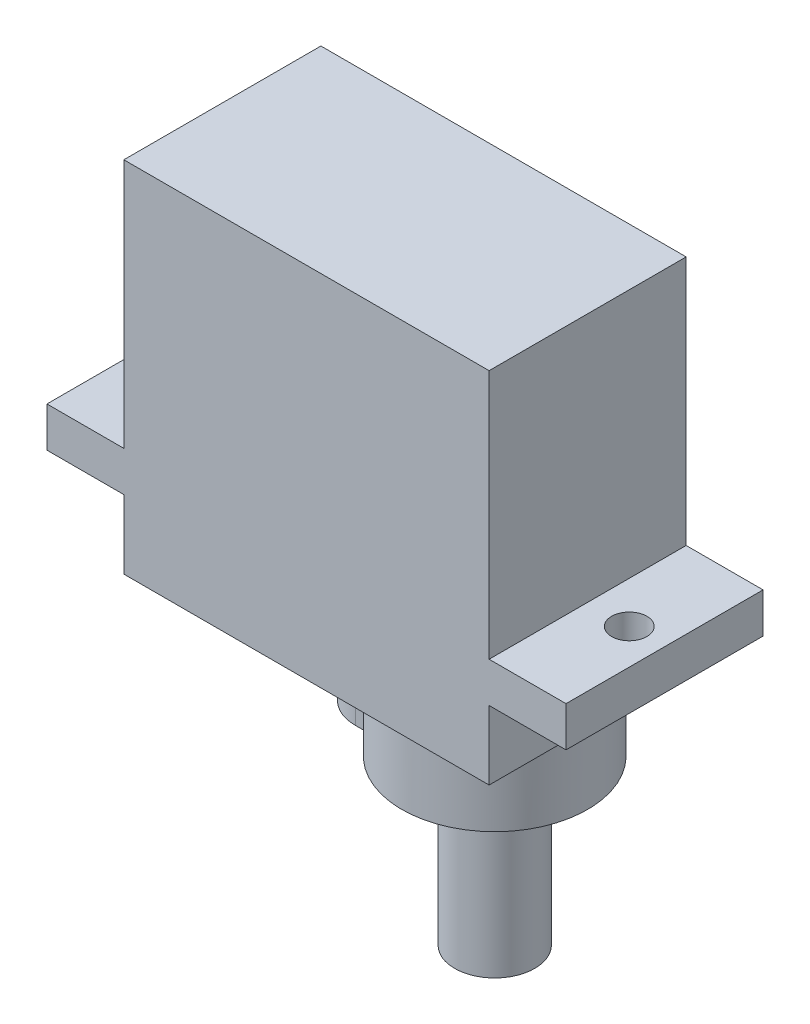
ISO-10303-21;
HEADER;
FILE_DESCRIPTION(('STEP AP214'),'2;1');
FILE_NAME('part.step','',(''),(''),'','','');
FILE_SCHEMA(('AUTOMOTIVE_DESIGN { 1 0 10303 214 1 1 1 1 }'));
ENDSEC;
DATA;
#1=APPLICATION_CONTEXT('core data for automotive mechanical design processes');
#2=APPLICATION_PROTOCOL_DEFINITION('international standard','automotive_design',2000,#1);
#3=PRODUCT_CONTEXT('',#1,'mechanical');
#4=PRODUCT('Part','Part','',(#3));
#5=PRODUCT_RELATED_PRODUCT_CATEGORY('part','',(#4));
#6=PRODUCT_DEFINITION_FORMATION('','',#4);
#7=PRODUCT_DEFINITION_CONTEXT('part definition',#1,'design');
#8=PRODUCT_DEFINITION('design','',#6,#7);
#9=PRODUCT_DEFINITION_SHAPE('','',#8);
#10=(LENGTH_UNIT() NAMED_UNIT(*) SI_UNIT(.MILLI.,.METRE.));
#11=(NAMED_UNIT(*) PLANE_ANGLE_UNIT() SI_UNIT($,.RADIAN.));
#12=(NAMED_UNIT(*) SI_UNIT($,.STERADIAN.) SOLID_ANGLE_UNIT());
#13=UNCERTAINTY_MEASURE_WITH_UNIT(LENGTH_MEASURE(1.E-05),#10,'distance_accuracy_value','');
#14=(GEOMETRIC_REPRESENTATION_CONTEXT(3) GLOBAL_UNCERTAINTY_ASSIGNED_CONTEXT((#13)) GLOBAL_UNIT_ASSIGNED_CONTEXT((#10,
#11,#12)) REPRESENTATION_CONTEXT('',''));
#15=CARTESIAN_POINT('',(0.,0.,0.));
#16=DIRECTION('',(0.,0.,1.));
#17=DIRECTION('',(1.,0.,0.));
#18=AXIS2_PLACEMENT_3D('',#15,#16,#17);
#19=CARTESIAN_POINT('',(5.60000000000001,-18.9406492438332,6.15));
#20=DIRECTION('',(0.,1.,0.));
#21=DIRECTION('',(-1.,0.,0.));
#22=AXIS2_PLACEMENT_3D('',#19,#20,#21);
#23=CYLINDRICAL_SURFACE('',#22,2.5);
#24=CARTESIAN_POINT('',(5.60000000000001,-18.9406492438332,6.15));
#25=DIRECTION('',(0.,-1.,0.));
#26=DIRECTION('',(1.,0.,0.));
#27=AXIS2_PLACEMENT_3D('',#24,#25,#26);
#28=CIRCLE('',#27,2.5);
#29=CARTESIAN_POINT('',(8.10000000000001,-18.9406492438332,6.15));
#30=VERTEX_POINT('',#29);
#31=EDGE_CURVE('E12',#30,#30,#28,.T.);
#32=ORIENTED_EDGE('',*,*,#31,.F.);
#33=EDGE_LOOP('',(#32));
#34=FACE_BOUND('',#33,.T.);
#35=CARTESIAN_POINT('',(5.60000000000001,-8.7,6.15));
#36=DIRECTION('',(0.,-1.,0.));
#37=DIRECTION('',(1.,0.,0.));
#38=AXIS2_PLACEMENT_3D('',#35,#36,#37);
#39=CIRCLE('',#38,2.5);
#40=CARTESIAN_POINT('',(8.10000000000001,-8.7,6.15));
#41=VERTEX_POINT('',#40);
#42=EDGE_CURVE('E46',#41,#41,#39,.T.);
#43=ORIENTED_EDGE('',*,*,#42,.T.);
#44=EDGE_LOOP('',(#43));
#45=FACE_BOUND('',#44,.T.);
#46=ADVANCED_FACE('F43',(#34,#45),#23,.T.);
#47=CARTESIAN_POINT('',(5.60000000000001,-18.9406492438332,6.15));
#48=DIRECTION('',(0.,-1.,0.));
#49=DIRECTION('',(1.,0.,0.));
#50=AXIS2_PLACEMENT_3D('',#47,#48,#49);
#51=PLANE('',#50);
#52=ORIENTED_EDGE('',*,*,#31,.T.);
#53=EDGE_LOOP('',(#52));
#54=FACE_BOUND('',#53,.T.);
#55=ADVANCED_FACE('F58',(#54),#51,.T.);
#56=CARTESIAN_POINT('',(5.60000000000001,-8.7,6.15));
#57=DIRECTION('',(0.,-1.,0.));
#58=DIRECTION('',(1.,0.,0.));
#59=AXIS2_PLACEMENT_3D('',#56,#57,#58);
#60=PLANE('',#59);
#61=ORIENTED_EDGE('',*,*,#42,.F.);
#62=EDGE_LOOP('',(#61));
#63=FACE_BOUND('',#62,.T.);
#64=ADVANCED_FACE('F56',(#63),#60,.F.);
#65=CLOSED_SHELL('',(#46,#55,#64));
#66=MANIFOLD_SOLID_BREP('B2',#65);
#67=CARTESIAN_POINT('',(-11.4,-4.3,12.3));
#68=DIRECTION('',(0.,1.,0.));
#69=DIRECTION('',(-1.,0.,0.));
#70=AXIS2_PLACEMENT_3D('',#67,#68,#69);
#71=PLANE('',#70);
#72=DIRECTION('',(-1.,0.,0.));
#73=VECTOR('',#72,1.);
#74=CARTESIAN_POINT('',(-0.399999999999992,-4.3,8.85));
#75=LINE('',#74,#73);
#76=CARTESIAN_POINT('',(0.466774892915768,-4.3,8.85));
#77=VERTEX_POINT('',#76);
#78=CARTESIAN_POINT('',(-0.399999999999992,-4.3,8.85));
#79=VERTEX_POINT('',#78);
#80=EDGE_CURVE('E100',#77,#79,#75,.T.);
#81=ORIENTED_EDGE('',*,*,#80,.F.);
#82=CARTESIAN_POINT('',(5.60000000000001,-4.3,6.15));
#83=DIRECTION('',(0.,-1.,0.));
#84=DIRECTION('',(1.,0.,0.));
#85=AXIS2_PLACEMENT_3D('',#82,#83,#84);
#86=CIRCLE('',#85,5.8);
#87=CARTESIAN_POINT('',(11.4,-4.3,6.15));
#88=VERTEX_POINT('',#87);
#89=EDGE_CURVE('E41',#88,#77,#86,.T.);
#90=ORIENTED_EDGE('',*,*,#89,.F.);
#91=DIRECTION('',(0.,0.,-1.));
#92=VECTOR('',#91,1.);
#93=CARTESIAN_POINT('',(11.4,-4.3,12.3));
#94=LINE('',#93,#92);
#95=CARTESIAN_POINT('',(11.4,-4.3,12.3));
#96=VERTEX_POINT('',#95);
#97=EDGE_CURVE('E301',#96,#88,#94,.T.);
#98=ORIENTED_EDGE('',*,*,#97,.F.);
#99=DIRECTION('',(1.,0.,0.));
#100=VECTOR('',#99,1.);
#101=CARTESIAN_POINT('',(-11.4,-4.3,12.3));
#102=LINE('',#101,#100);
#103=CARTESIAN_POINT('',(-11.4,-4.3,12.3));
#104=VERTEX_POINT('',#103);
#105=EDGE_CURVE('E237',#104,#96,#102,.T.);
#106=ORIENTED_EDGE('',*,*,#105,.F.);
#107=DIRECTION('',(0.,0.,-1.));
#108=VECTOR('',#107,1.);
#109=CARTESIAN_POINT('',(-11.4,-4.3,12.3));
#110=LINE('',#109,#108);
#111=CARTESIAN_POINT('',(-11.4,-4.3,0.));
#112=VERTEX_POINT('',#111);
#113=EDGE_CURVE('E304',#104,#112,#110,.T.);
#114=ORIENTED_EDGE('',*,*,#113,.T.);
#115=DIRECTION('',(1.,0.,0.));
#116=VECTOR('',#115,1.);
#117=CARTESIAN_POINT('',(-11.4,-4.3,0.));
#118=LINE('',#117,#116);
#119=CARTESIAN_POINT('',(11.4,-4.3,0.));
#120=VERTEX_POINT('',#119);
#121=EDGE_CURVE('E259',#112,#120,#118,.T.);
#122=ORIENTED_EDGE('',*,*,#121,.T.);
#123=EDGE_CURVE('E300',#88,#120,#94,.T.);
#124=ORIENTED_EDGE('',*,*,#123,.F.);
#125=CARTESIAN_POINT('',(0.466774892915769,-4.3,3.45));
#126=VERTEX_POINT('',#125);
#127=EDGE_CURVE('E93',#126,#88,#86,.T.);
#128=ORIENTED_EDGE('',*,*,#127,.F.);
#129=DIRECTION('',(1.,0.,0.));
#130=VECTOR('',#129,1.);
#131=CARTESIAN_POINT('',(-0.399999999999992,-4.3,3.45));
#132=LINE('',#131,#130);
#133=CARTESIAN_POINT('',(-0.399999999999992,-4.3,3.45));
#134=VERTEX_POINT('',#133);
#135=EDGE_CURVE('E370',#134,#126,#132,.T.);
#136=ORIENTED_EDGE('',*,*,#135,.F.);
#137=CARTESIAN_POINT('',(-0.399999999999992,-4.3,6.15));
#138=DIRECTION('',(0.,-1.,0.));
#139=DIRECTION('',(1.,0.,0.));
#140=AXIS2_PLACEMENT_3D('',#137,#138,#139);
#141=CIRCLE('',#140,2.7);
#142=EDGE_CURVE('E104',#79,#134,#141,.T.);
#143=ORIENTED_EDGE('',*,*,#142,.F.);
#144=EDGE_LOOP('',(#81,#90,#98,#106,#114,#122,#124,#128,#136,#143));
#145=FACE_BOUND('',#144,.T.);
#146=ADVANCED_FACE('F83',(#145),#71,.F.);
#147=CARTESIAN_POINT('',(-16.2,2.5,12.3));
#148=DIRECTION('',(1.,0.,0.));
#149=DIRECTION('',(0.,0.,-1.));
#150=AXIS2_PLACEMENT_3D('',#147,#148,#149);
#151=PLANE('',#150);
#152=DIRECTION('',(0.,-1.,0.));
#153=VECTOR('',#152,1.);
#154=CARTESIAN_POINT('',(-16.2,2.5,0.));
#155=LINE('',#154,#153);
#156=CARTESIAN_POINT('',(-16.2,2.5,0.));
#157=VERTEX_POINT('',#156);
#158=CARTESIAN_POINT('',(-16.2,0.,0.));
#159=VERTEX_POINT('',#158);
#160=EDGE_CURVE('E220',#157,#159,#155,.T.);
#161=ORIENTED_EDGE('',*,*,#160,.T.);
#162=DIRECTION('',(0.,0.,-1.));
#163=VECTOR('',#162,1.);
#164=CARTESIAN_POINT('',(-16.2,0.,12.3));
#165=LINE('',#164,#163);
#166=CARTESIAN_POINT('',(-16.2,0.,12.3));
#167=VERTEX_POINT('',#166);
#168=EDGE_CURVE('E87',#167,#159,#165,.T.);
#169=ORIENTED_EDGE('',*,*,#168,.F.);
#170=DIRECTION('',(0.,-1.,0.));
#171=VECTOR('',#170,1.);
#172=CARTESIAN_POINT('',(-16.2,2.5,12.3));
#173=LINE('',#172,#171);
#174=CARTESIAN_POINT('',(-16.2,2.5,12.3));
#175=VERTEX_POINT('',#174);
#176=EDGE_CURVE('E229',#175,#167,#173,.T.);
#177=ORIENTED_EDGE('',*,*,#176,.F.);
#178=DIRECTION('',(0.,0.,-1.));
#179=VECTOR('',#178,1.);
#180=CARTESIAN_POINT('',(-16.2,2.5,12.3));
#181=LINE('',#180,#179);
#182=EDGE_CURVE('E254',#175,#157,#181,.T.);
#183=ORIENTED_EDGE('',*,*,#182,.T.);
#184=EDGE_LOOP('',(#161,#169,#177,#183));
#185=FACE_BOUND('',#184,.T.);
#186=ADVANCED_FACE('F85',(#185),#151,.F.);
#187=CARTESIAN_POINT('',(-16.2,0.,12.3));
#188=DIRECTION('',(0.,1.,0.));
#189=DIRECTION('',(-1.,0.,0.));
#190=AXIS2_PLACEMENT_3D('',#187,#188,#189);
#191=PLANE('',#190);
#192=CARTESIAN_POINT('',(-14.,0.,6.15));
#193=DIRECTION('',(0.,1.,0.));
#194=DIRECTION('',(-1.,0.,0.));
#195=AXIS2_PLACEMENT_3D('',#192,#193,#194);
#196=CIRCLE('',#195,1.1);
#197=CARTESIAN_POINT('',(-15.1,0.,6.15));
#198=VERTEX_POINT('',#197);
#199=EDGE_CURVE('E380',#198,#198,#196,.T.);
#200=ORIENTED_EDGE('',*,*,#199,.T.);
#201=EDGE_LOOP('',(#200));
#202=FACE_BOUND('',#201,.T.);
#203=DIRECTION('',(1.,0.,0.));
#204=VECTOR('',#203,1.);
#205=CARTESIAN_POINT('',(-16.2,0.,0.));
#206=LINE('',#205,#204);
#207=CARTESIAN_POINT('',(-11.4,0.,0.));
#208=VERTEX_POINT('',#207);
#209=EDGE_CURVE('E223',#159,#208,#206,.T.);
#210=ORIENTED_EDGE('',*,*,#209,.T.);
#211=DIRECTION('',(0.,0.,-1.));
#212=VECTOR('',#211,1.);
#213=CARTESIAN_POINT('',(-11.4,0.,12.3));
#214=LINE('',#213,#212);
#215=CARTESIAN_POINT('',(-11.4,0.,12.3));
#216=VERTEX_POINT('',#215);
#217=EDGE_CURVE('E306',#216,#208,#214,.T.);
#218=ORIENTED_EDGE('',*,*,#217,.F.);
#219=DIRECTION('',(1.,0.,0.));
#220=VECTOR('',#219,1.);
#221=CARTESIAN_POINT('',(-16.2,0.,12.3));
#222=LINE('',#221,#220);
#223=EDGE_CURVE('E232',#167,#216,#222,.T.);
#224=ORIENTED_EDGE('',*,*,#223,.F.);
#225=ORIENTED_EDGE('',*,*,#168,.T.);
#226=EDGE_LOOP('',(#210,#218,#224,#225));
#227=FACE_BOUND('',#226,.T.);
#228=ADVANCED_FACE('F315',(#202,#227),#191,.F.);
#229=CARTESIAN_POINT('',(-11.4,0.,12.3));
#230=DIRECTION('',(1.,0.,0.));
#231=DIRECTION('',(0.,0.,-1.));
#232=AXIS2_PLACEMENT_3D('',#229,#230,#231);
#233=PLANE('',#232);
#234=DIRECTION('',(0.,-1.,0.));
#235=VECTOR('',#234,1.);
#236=CARTESIAN_POINT('',(-11.4,0.,0.));
#237=LINE('',#236,#235);
#238=EDGE_CURVE('E257',#208,#112,#237,.T.);
#239=ORIENTED_EDGE('',*,*,#238,.T.);
#240=ORIENTED_EDGE('',*,*,#113,.F.);
#241=DIRECTION('',(0.,-1.,0.));
#242=VECTOR('',#241,1.);
#243=CARTESIAN_POINT('',(-11.4,0.,12.3));
#244=LINE('',#243,#242);
#245=EDGE_CURVE('E235',#216,#104,#244,.T.);
#246=ORIENTED_EDGE('',*,*,#245,.F.);
#247=ORIENTED_EDGE('',*,*,#217,.T.);
#248=EDGE_LOOP('',(#239,#240,#246,#247));
#249=FACE_BOUND('',#248,.T.);
#250=ADVANCED_FACE('F327',(#249),#233,.F.);
#251=CARTESIAN_POINT('',(11.4,-4.3,12.3));
#252=DIRECTION('',(-1.,0.,0.));
#253=DIRECTION('',(0.,-1.,0.));
#254=AXIS2_PLACEMENT_3D('',#251,#252,#253);
#255=PLANE('',#254);
#256=DIRECTION('',(0.,1.,0.));
#257=VECTOR('',#256,1.);
#258=CARTESIAN_POINT('',(11.4,-4.3,0.));
#259=LINE('',#258,#257);
#260=CARTESIAN_POINT('',(11.4,0.,0.));
#261=VERTEX_POINT('',#260);
#262=EDGE_CURVE('E262',#120,#261,#259,.T.);
#263=ORIENTED_EDGE('',*,*,#262,.T.);
#264=DIRECTION('',(0.,0.,-1.));
#265=VECTOR('',#264,1.);
#266=CARTESIAN_POINT('',(11.4,0.,12.3));
#267=LINE('',#266,#265);
#268=CARTESIAN_POINT('',(11.4,0.,12.3));
#269=VERTEX_POINT('',#268);
#270=EDGE_CURVE('E297',#269,#261,#267,.T.);
#271=ORIENTED_EDGE('',*,*,#270,.F.);
#272=DIRECTION('',(0.,1.,0.));
#273=VECTOR('',#272,1.);
#274=CARTESIAN_POINT('',(11.4,-4.3,12.3));
#275=LINE('',#274,#273);
#276=EDGE_CURVE('E239',#96,#269,#275,.T.);
#277=ORIENTED_EDGE('',*,*,#276,.F.);
#278=ORIENTED_EDGE('',*,*,#97,.T.);
#279=ORIENTED_EDGE('',*,*,#123,.T.);
#280=EDGE_LOOP('',(#263,#271,#277,#278,#279));
#281=FACE_BOUND('',#280,.T.);
#282=ADVANCED_FACE('F368',(#281),#255,.F.);
#283=CARTESIAN_POINT('',(11.4,0.,12.3));
#284=DIRECTION('',(0.,1.,0.));
#285=DIRECTION('',(-1.,0.,0.));
#286=AXIS2_PLACEMENT_3D('',#283,#284,#285);
#287=PLANE('',#286);
#288=CARTESIAN_POINT('',(14.,0.,6.15));
#289=DIRECTION('',(0.,1.,0.));
#290=DIRECTION('',(-1.,0.,0.));
#291=AXIS2_PLACEMENT_3D('',#288,#289,#290);
#292=CIRCLE('',#291,1.1);
#293=CARTESIAN_POINT('',(12.9,0.,6.15));
#294=VERTEX_POINT('',#293);
#295=EDGE_CURVE('E413',#294,#294,#292,.T.);
#296=ORIENTED_EDGE('',*,*,#295,.T.);
#297=EDGE_LOOP('',(#296));
#298=FACE_BOUND('',#297,.T.);
#299=DIRECTION('',(1.,0.,0.));
#300=VECTOR('',#299,1.);
#301=CARTESIAN_POINT('',(11.4,0.,0.));
#302=LINE('',#301,#300);
#303=CARTESIAN_POINT('',(16.2,0.,0.));
#304=VERTEX_POINT('',#303);
#305=EDGE_CURVE('E264',#261,#304,#302,.T.);
#306=ORIENTED_EDGE('',*,*,#305,.T.);
#307=DIRECTION('',(0.,0.,-1.));
#308=VECTOR('',#307,1.);
#309=CARTESIAN_POINT('',(16.2,0.,12.3));
#310=LINE('',#309,#308);
#311=CARTESIAN_POINT('',(16.2,0.,12.3));
#312=VERTEX_POINT('',#311);
#313=EDGE_CURVE('E294',#312,#304,#310,.T.);
#314=ORIENTED_EDGE('',*,*,#313,.F.);
#315=DIRECTION('',(1.,0.,0.));
#316=VECTOR('',#315,1.);
#317=CARTESIAN_POINT('',(11.4,0.,12.3));
#318=LINE('',#317,#316);
#319=EDGE_CURVE('E241',#269,#312,#318,.T.);
#320=ORIENTED_EDGE('',*,*,#319,.F.);
#321=ORIENTED_EDGE('',*,*,#270,.T.);
#322=EDGE_LOOP('',(#306,#314,#320,#321));
#323=FACE_BOUND('',#322,.T.);
#324=ADVANCED_FACE('F366',(#298,#323),#287,.F.);
#325=CARTESIAN_POINT('',(16.2,0.,12.3));
#326=DIRECTION('',(-1.,0.,0.));
#327=DIRECTION('',(0.,-1.,0.));
#328=AXIS2_PLACEMENT_3D('',#325,#326,#327);
#329=PLANE('',#328);
#330=DIRECTION('',(0.,1.,0.));
#331=VECTOR('',#330,1.);
#332=CARTESIAN_POINT('',(16.2,0.,0.));
#333=LINE('',#332,#331);
#334=CARTESIAN_POINT('',(16.2,2.5,0.));
#335=VERTEX_POINT('',#334);
#336=EDGE_CURVE('E266',#304,#335,#333,.T.);
#337=ORIENTED_EDGE('',*,*,#336,.T.);
#338=DIRECTION('',(0.,0.,-1.));
#339=VECTOR('',#338,1.);
#340=CARTESIAN_POINT('',(16.2,2.5,12.3));
#341=LINE('',#340,#339);
#342=CARTESIAN_POINT('',(16.2,2.5,12.3));
#343=VERTEX_POINT('',#342);
#344=EDGE_CURVE('E291',#343,#335,#341,.T.);
#345=ORIENTED_EDGE('',*,*,#344,.F.);
#346=DIRECTION('',(0.,1.,0.));
#347=VECTOR('',#346,1.);
#348=CARTESIAN_POINT('',(16.2,0.,12.3));
#349=LINE('',#348,#347);
#350=EDGE_CURVE('E243',#312,#343,#349,.T.);
#351=ORIENTED_EDGE('',*,*,#350,.F.);
#352=ORIENTED_EDGE('',*,*,#313,.T.);
#353=EDGE_LOOP('',(#337,#345,#351,#352));
#354=FACE_BOUND('',#353,.T.);
#355=ADVANCED_FACE('F361',(#354),#329,.F.);
#356=CARTESIAN_POINT('',(16.2,2.5,12.3));
#357=DIRECTION('',(0.,-1.,0.));
#358=DIRECTION('',(1.,0.,0.));
#359=AXIS2_PLACEMENT_3D('',#356,#357,#358);
#360=PLANE('',#359);
#361=CARTESIAN_POINT('',(14.,2.5,6.15));
#362=DIRECTION('',(0.,1.,0.));
#363=DIRECTION('',(0.,0.,1.));
#364=AXIS2_PLACEMENT_3D('',#361,#362,#363);
#365=CIRCLE('',#364,1.1);
#366=CARTESIAN_POINT('',(14.,2.5,7.25));
#367=VERTEX_POINT('',#366);
#368=EDGE_CURVE('E418',#367,#367,#365,.T.);
#369=ORIENTED_EDGE('',*,*,#368,.F.);
#370=EDGE_LOOP('',(#369));
#371=FACE_BOUND('',#370,.T.);
#372=DIRECTION('',(-1.,0.,0.));
#373=VECTOR('',#372,1.);
#374=CARTESIAN_POINT('',(16.2,2.5,0.));
#375=LINE('',#374,#373);
#376=CARTESIAN_POINT('',(11.4,2.5,0.));
#377=VERTEX_POINT('',#376);
#378=EDGE_CURVE('E268',#335,#377,#375,.T.);
#379=ORIENTED_EDGE('',*,*,#378,.T.);
#380=DIRECTION('',(0.,0.,-1.));
#381=VECTOR('',#380,1.);
#382=CARTESIAN_POINT('',(11.4,2.5,12.3));
#383=LINE('',#382,#381);
#384=CARTESIAN_POINT('',(11.4,2.5,12.3));
#385=VERTEX_POINT('',#384);
#386=EDGE_CURVE('E288',#385,#377,#383,.T.);
#387=ORIENTED_EDGE('',*,*,#386,.F.);
#388=DIRECTION('',(-1.,0.,0.));
#389=VECTOR('',#388,1.);
#390=CARTESIAN_POINT('',(16.2,2.5,12.3));
#391=LINE('',#390,#389);
#392=EDGE_CURVE('E245',#343,#385,#391,.T.);
#393=ORIENTED_EDGE('',*,*,#392,.F.);
#394=ORIENTED_EDGE('',*,*,#344,.T.);
#395=EDGE_LOOP('',(#379,#387,#393,#394));
#396=FACE_BOUND('',#395,.T.);
#397=ADVANCED_FACE('F356',(#371,#396),#360,.F.);
#398=CARTESIAN_POINT('',(11.4,2.5,12.3));
#399=DIRECTION('',(-1.,0.,0.));
#400=DIRECTION('',(0.,-1.,0.));
#401=AXIS2_PLACEMENT_3D('',#398,#399,#400);
#402=PLANE('',#401);
#403=DIRECTION('',(0.,1.,0.));
#404=VECTOR('',#403,1.);
#405=CARTESIAN_POINT('',(11.4,2.5,0.));
#406=LINE('',#405,#404);
#407=CARTESIAN_POINT('',(11.4,18.1,0.));
#408=VERTEX_POINT('',#407);
#409=EDGE_CURVE('E270',#377,#408,#406,.T.);
#410=ORIENTED_EDGE('',*,*,#409,.T.);
#411=DIRECTION('',(0.,0.,-1.));
#412=VECTOR('',#411,1.);
#413=CARTESIAN_POINT('',(11.4,18.1,12.3));
#414=LINE('',#413,#412);
#415=CARTESIAN_POINT('',(11.4,18.1,12.3));
#416=VERTEX_POINT('',#415);
#417=EDGE_CURVE('E285',#416,#408,#414,.T.);
#418=ORIENTED_EDGE('',*,*,#417,.F.);
#419=DIRECTION('',(0.,1.,0.));
#420=VECTOR('',#419,1.);
#421=CARTESIAN_POINT('',(11.4,2.5,12.3));
#422=LINE('',#421,#420);
#423=EDGE_CURVE('E247',#385,#416,#422,.T.);
#424=ORIENTED_EDGE('',*,*,#423,.F.);
#425=ORIENTED_EDGE('',*,*,#386,.T.);
#426=EDGE_LOOP('',(#410,#418,#424,#425));
#427=FACE_BOUND('',#426,.T.);
#428=ADVANCED_FACE('F352',(#427),#402,.F.);
#429=CARTESIAN_POINT('',(11.4,18.1,12.3));
#430=DIRECTION('',(0.,-1.,0.));
#431=DIRECTION('',(1.,0.,0.));
#432=AXIS2_PLACEMENT_3D('',#429,#430,#431);
#433=PLANE('',#432);
#434=DIRECTION('',(-1.,0.,0.));
#435=VECTOR('',#434,1.);
#436=CARTESIAN_POINT('',(11.4,18.1,0.));
#437=LINE('',#436,#435);
#438=CARTESIAN_POINT('',(-11.4,18.1,0.));
#439=VERTEX_POINT('',#438);
#440=EDGE_CURVE('E272',#408,#439,#437,.T.);
#441=ORIENTED_EDGE('',*,*,#440,.T.);
#442=DIRECTION('',(0.,0.,-1.));
#443=VECTOR('',#442,1.);
#444=CARTESIAN_POINT('',(-11.4,18.1,12.3));
#445=LINE('',#444,#443);
#446=CARTESIAN_POINT('',(-11.4,18.1,12.3));
#447=VERTEX_POINT('',#446);
#448=EDGE_CURVE('E282',#447,#439,#445,.T.);
#449=ORIENTED_EDGE('',*,*,#448,.F.);
#450=DIRECTION('',(-1.,0.,0.));
#451=VECTOR('',#450,1.);
#452=CARTESIAN_POINT('',(11.4,18.1,12.3));
#453=LINE('',#452,#451);
#454=EDGE_CURVE('E249',#416,#447,#453,.T.);
#455=ORIENTED_EDGE('',*,*,#454,.F.);
#456=ORIENTED_EDGE('',*,*,#417,.T.);
#457=EDGE_LOOP('',(#441,#449,#455,#456));
#458=FACE_BOUND('',#457,.T.);
#459=ADVANCED_FACE('F347',(#458),#433,.F.);
#460=CARTESIAN_POINT('',(-11.4,18.1,12.3));
#461=DIRECTION('',(1.,0.,0.));
#462=DIRECTION('',(0.,0.,-1.));
#463=AXIS2_PLACEMENT_3D('',#460,#461,#462);
#464=PLANE('',#463);
#465=DIRECTION('',(0.,-1.,0.));
#466=VECTOR('',#465,1.);
#467=CARTESIAN_POINT('',(-11.4,18.1,0.));
#468=LINE('',#467,#466);
#469=CARTESIAN_POINT('',(-11.4,2.5,0.));
#470=VERTEX_POINT('',#469);
#471=EDGE_CURVE('E274',#439,#470,#468,.T.);
#472=ORIENTED_EDGE('',*,*,#471,.T.);
#473=DIRECTION('',(0.,0.,-1.));
#474=VECTOR('',#473,1.);
#475=CARTESIAN_POINT('',(-11.4,2.5,12.3));
#476=LINE('',#475,#474);
#477=CARTESIAN_POINT('',(-11.4,2.5,12.3));
#478=VERTEX_POINT('',#477);
#479=EDGE_CURVE('E279',#478,#470,#476,.T.);
#480=ORIENTED_EDGE('',*,*,#479,.F.);
#481=DIRECTION('',(0.,-1.,0.));
#482=VECTOR('',#481,1.);
#483=CARTESIAN_POINT('',(-11.4,18.1,12.3));
#484=LINE('',#483,#482);
#485=EDGE_CURVE('E251',#447,#478,#484,.T.);
#486=ORIENTED_EDGE('',*,*,#485,.F.);
#487=ORIENTED_EDGE('',*,*,#448,.T.);
#488=EDGE_LOOP('',(#472,#480,#486,#487));
#489=FACE_BOUND('',#488,.T.);
#490=ADVANCED_FACE('F341',(#489),#464,.F.);
#491=CARTESIAN_POINT('',(-11.4,2.5,12.3));
#492=DIRECTION('',(0.,-1.,0.));
#493=DIRECTION('',(1.,0.,0.));
#494=AXIS2_PLACEMENT_3D('',#491,#492,#493);
#495=PLANE('',#494);
#496=CARTESIAN_POINT('',(-14.,2.5,6.15));
#497=DIRECTION('',(0.,1.,0.));
#498=DIRECTION('',(0.,0.,1.));
#499=AXIS2_PLACEMENT_3D('',#496,#497,#498);
#500=CIRCLE('',#499,1.1);
#501=CARTESIAN_POINT('',(-14.,2.5,7.25));
#502=VERTEX_POINT('',#501);
#503=EDGE_CURVE('E410',#502,#502,#500,.T.);
#504=ORIENTED_EDGE('',*,*,#503,.F.);
#505=EDGE_LOOP('',(#504));
#506=FACE_BOUND('',#505,.T.);
#507=DIRECTION('',(-1.,0.,0.));
#508=VECTOR('',#507,1.);
#509=CARTESIAN_POINT('',(-11.4,2.5,0.));
#510=LINE('',#509,#508);
#511=EDGE_CURVE('E233',#470,#157,#510,.T.);
#512=ORIENTED_EDGE('',*,*,#511,.T.);
#513=ORIENTED_EDGE('',*,*,#182,.F.);
#514=DIRECTION('',(-1.,0.,0.));
#515=VECTOR('',#514,1.);
#516=CARTESIAN_POINT('',(-11.4,2.5,12.3));
#517=LINE('',#516,#515);
#518=EDGE_CURVE('E253',#478,#175,#517,.T.);
#519=ORIENTED_EDGE('',*,*,#518,.F.);
#520=ORIENTED_EDGE('',*,*,#479,.T.);
#521=EDGE_LOOP('',(#512,#513,#519,#520));
#522=FACE_BOUND('',#521,.T.);
#523=ADVANCED_FACE('F339',(#506,#522),#495,.F.);
#524=CARTESIAN_POINT('',(0.,0.,12.3));
#525=DIRECTION('',(0.,0.,1.));
#526=DIRECTION('',(1.,0.,0.));
#527=AXIS2_PLACEMENT_3D('',#524,#525,#526);
#528=PLANE('',#527);
#529=ORIENTED_EDGE('',*,*,#176,.T.);
#530=ORIENTED_EDGE('',*,*,#223,.T.);
#531=ORIENTED_EDGE('',*,*,#245,.T.);
#532=ORIENTED_EDGE('',*,*,#105,.T.);
#533=ORIENTED_EDGE('',*,*,#276,.T.);
#534=ORIENTED_EDGE('',*,*,#319,.T.);
#535=ORIENTED_EDGE('',*,*,#350,.T.);
#536=ORIENTED_EDGE('',*,*,#392,.T.);
#537=ORIENTED_EDGE('',*,*,#423,.T.);
#538=ORIENTED_EDGE('',*,*,#454,.T.);
#539=ORIENTED_EDGE('',*,*,#485,.T.);
#540=ORIENTED_EDGE('',*,*,#518,.T.);
#541=EDGE_LOOP('',(#529,#530,#531,#532,#533,#534,#535,#536,#537,#538,#539,#540));
#542=FACE_BOUND('',#541,.T.);
#543=ADVANCED_FACE('F333',(#542),#528,.T.);
#544=CARTESIAN_POINT('',(0.,0.,0.));
#545=DIRECTION('',(0.,0.,1.));
#546=DIRECTION('',(1.,0.,0.));
#547=AXIS2_PLACEMENT_3D('',#544,#545,#546);
#548=PLANE('',#547);
#549=ORIENTED_EDGE('',*,*,#160,.F.);
#550=ORIENTED_EDGE('',*,*,#511,.F.);
#551=ORIENTED_EDGE('',*,*,#471,.F.);
#552=ORIENTED_EDGE('',*,*,#440,.F.);
#553=ORIENTED_EDGE('',*,*,#409,.F.);
#554=ORIENTED_EDGE('',*,*,#378,.F.);
#555=ORIENTED_EDGE('',*,*,#336,.F.);
#556=ORIENTED_EDGE('',*,*,#305,.F.);
#557=ORIENTED_EDGE('',*,*,#262,.F.);
#558=ORIENTED_EDGE('',*,*,#121,.F.);
#559=ORIENTED_EDGE('',*,*,#238,.F.);
#560=ORIENTED_EDGE('',*,*,#209,.F.);
#561=EDGE_LOOP('',(#549,#550,#551,#552,#553,#554,#555,#556,#557,#558,#559,#560));
#562=FACE_BOUND('',#561,.T.);
#563=ADVANCED_FACE('F322',(#562),#548,.F.);
#564=CARTESIAN_POINT('',(-0.399999999999991,-8.7,6.15));
#565=DIRECTION('',(0.,1.,0.));
#566=DIRECTION('',(-1.,0.,0.));
#567=AXIS2_PLACEMENT_3D('',#564,#565,#566);
#568=CYLINDRICAL_SURFACE('',#567,2.7);
#569=ORIENTED_EDGE('',*,*,#142,.T.);
#570=DIRECTION('',(0.,1.,0.));
#571=VECTOR('',#570,1.);
#572=CARTESIAN_POINT('',(-0.399999999999991,-8.7,3.45));
#573=LINE('',#572,#571);
#574=CARTESIAN_POINT('',(-0.399999999999991,-8.7,3.45));
#575=VERTEX_POINT('',#574);
#576=EDGE_CURVE('E203',#575,#134,#573,.T.);
#577=ORIENTED_EDGE('',*,*,#576,.F.);
#578=CARTESIAN_POINT('',(-0.399999999999991,-8.7,6.15));
#579=DIRECTION('',(0.,-1.,0.));
#580=DIRECTION('',(1.,0.,0.));
#581=AXIS2_PLACEMENT_3D('',#578,#579,#580);
#582=CIRCLE('',#581,2.7);
#583=CARTESIAN_POINT('',(-0.399999999999992,-8.7,8.85));
#584=VERTEX_POINT('',#583);
#585=EDGE_CURVE('E209',#584,#575,#582,.T.);
#586=ORIENTED_EDGE('',*,*,#585,.F.);
#587=DIRECTION('',(0.,1.,0.));
#588=VECTOR('',#587,1.);
#589=CARTESIAN_POINT('',(-0.399999999999992,-8.7,8.85));
#590=LINE('',#589,#588);
#591=EDGE_CURVE('E377',#584,#79,#590,.T.);
#592=ORIENTED_EDGE('',*,*,#591,.T.);
#593=EDGE_LOOP('',(#569,#577,#586,#592));
#594=FACE_BOUND('',#593,.T.);
#595=ADVANCED_FACE('F219',(#594),#568,.T.);
#596=CARTESIAN_POINT('',(-0.399999999999991,-8.7,3.45));
#597=DIRECTION('',(0.,0.,1.));
#598=DIRECTION('',(1.,0.,0.));
#599=AXIS2_PLACEMENT_3D('',#596,#597,#598);
#600=PLANE('',#599);
#601=ORIENTED_EDGE('',*,*,#135,.T.);
#602=DIRECTION('',(0.,1.,0.));
#603=VECTOR('',#602,1.);
#604=CARTESIAN_POINT('',(0.466774892915769,-8.7,3.45));
#605=LINE('',#604,#603);
#606=CARTESIAN_POINT('',(0.466774892915769,-8.7,3.45));
#607=VERTEX_POINT('',#606);
#608=EDGE_CURVE('E205',#607,#126,#605,.T.);
#609=ORIENTED_EDGE('',*,*,#608,.F.);
#610=DIRECTION('',(1.,0.,0.));
#611=VECTOR('',#610,1.);
#612=CARTESIAN_POINT('',(-0.399999999999991,-8.7,3.45));
#613=LINE('',#612,#611);
#614=EDGE_CURVE('E198',#575,#607,#613,.T.);
#615=ORIENTED_EDGE('',*,*,#614,.F.);
#616=ORIENTED_EDGE('',*,*,#576,.T.);
#617=EDGE_LOOP('',(#601,#609,#615,#616));
#618=FACE_BOUND('',#617,.T.);
#619=ADVANCED_FACE('F201',(#618),#600,.F.);
#620=CARTESIAN_POINT('',(5.60000000000001,-8.7,6.15));
#621=DIRECTION('',(0.,1.,0.));
#622=DIRECTION('',(-1.,0.,0.));
#623=AXIS2_PLACEMENT_3D('',#620,#621,#622);
#624=CYLINDRICAL_SURFACE('',#623,5.8);
#625=ORIENTED_EDGE('',*,*,#127,.T.);
#626=ORIENTED_EDGE('',*,*,#89,.T.);
#627=DIRECTION('',(0.,1.,0.));
#628=VECTOR('',#627,1.);
#629=CARTESIAN_POINT('',(0.466774892915769,-8.7,8.85));
#630=LINE('',#629,#628);
#631=CARTESIAN_POINT('',(0.466774892915769,-8.7,8.85));
#632=VERTEX_POINT('',#631);
#633=EDGE_CURVE('E225',#632,#77,#630,.T.);
#634=ORIENTED_EDGE('',*,*,#633,.F.);
#635=CARTESIAN_POINT('',(5.60000000000001,-8.7,6.15));
#636=DIRECTION('',(0.,-1.,0.));
#637=DIRECTION('',(1.,0.,0.));
#638=AXIS2_PLACEMENT_3D('',#635,#636,#637);
#639=CIRCLE('',#638,5.8);
#640=EDGE_CURVE('E208',#607,#632,#639,.T.);
#641=ORIENTED_EDGE('',*,*,#640,.F.);
#642=ORIENTED_EDGE('',*,*,#608,.T.);
#643=EDGE_LOOP('',(#625,#626,#634,#641,#642));
#644=FACE_BOUND('',#643,.T.);
#645=ADVANCED_FACE('F373',(#644),#624,.T.);
#646=CARTESIAN_POINT('',(-0.399999999999992,-8.7,8.85));
#647=DIRECTION('',(0.,0.,-1.));
#648=DIRECTION('',(-1.,0.,0.));
#649=AXIS2_PLACEMENT_3D('',#646,#647,#648);
#650=PLANE('',#649);
#651=ORIENTED_EDGE('',*,*,#80,.T.);
#652=ORIENTED_EDGE('',*,*,#591,.F.);
#653=DIRECTION('',(-1.,0.,0.));
#654=VECTOR('',#653,1.);
#655=CARTESIAN_POINT('',(-0.399999999999992,-8.7,8.85));
#656=LINE('',#655,#654);
#657=EDGE_CURVE('E214',#632,#584,#656,.T.);
#658=ORIENTED_EDGE('',*,*,#657,.F.);
#659=ORIENTED_EDGE('',*,*,#633,.T.);
#660=EDGE_LOOP('',(#651,#652,#658,#659));
#661=FACE_BOUND('',#660,.T.);
#662=ADVANCED_FACE('F384',(#661),#650,.F.);
#663=CARTESIAN_POINT('',(-0.399999999999991,-8.7,6.15));
#664=DIRECTION('',(0.,-1.,0.));
#665=DIRECTION('',(1.,0.,0.));
#666=AXIS2_PLACEMENT_3D('',#663,#664,#665);
#667=PLANE('',#666);
#668=ORIENTED_EDGE('',*,*,#585,.T.);
#669=ORIENTED_EDGE('',*,*,#614,.T.);
#670=ORIENTED_EDGE('',*,*,#640,.T.);
#671=ORIENTED_EDGE('',*,*,#657,.T.);
#672=EDGE_LOOP('',(#668,#669,#670,#671));
#673=FACE_BOUND('',#672,.T.);
#674=ADVANCED_FACE('F212',(#673),#667,.T.);
#675=CARTESIAN_POINT('',(-14.,-5.5,6.15));
#676=DIRECTION('',(0.,1.,0.));
#677=DIRECTION('',(0.,0.,1.));
#678=AXIS2_PLACEMENT_3D('',#675,#676,#677);
#679=CYLINDRICAL_SURFACE('',#678,1.1);
#680=ORIENTED_EDGE('',*,*,#503,.T.);
#681=EDGE_LOOP('',(#680));
#682=FACE_BOUND('',#681,.T.);
#683=ORIENTED_EDGE('',*,*,#199,.F.);
#684=EDGE_LOOP('',(#683));
#685=FACE_BOUND('',#684,.T.);
#686=ADVANCED_FACE('F391',(#682,#685),#679,.F.);
#687=CARTESIAN_POINT('',(14.,-5.5,6.15));
#688=DIRECTION('',(0.,1.,0.));
#689=DIRECTION('',(0.,0.,1.));
#690=AXIS2_PLACEMENT_3D('',#687,#688,#689);
#691=CYLINDRICAL_SURFACE('',#690,1.1);
#692=ORIENTED_EDGE('',*,*,#368,.T.);
#693=EDGE_LOOP('',(#692));
#694=FACE_BOUND('',#693,.T.);
#695=ORIENTED_EDGE('',*,*,#295,.F.);
#696=EDGE_LOOP('',(#695));
#697=FACE_BOUND('',#696,.T.);
#698=ADVANCED_FACE('F422',(#694,#697),#691,.F.);
#699=CLOSED_SHELL('',(#146,#186,#228,#250,#282,#324,#355,#397,#428,#459,#490,#523,#543,#563,
#595,#619,#645,#662,#674,#686,#698));
#700=MANIFOLD_SOLID_BREP('B7',#699);
#701=ADVANCED_BREP_SHAPE_REPRESENTATION('',(#18,#66,#700),#14);
#702=SHAPE_DEFINITION_REPRESENTATION(#9,#701);
ENDSEC;
END-ISO-10303-21;
